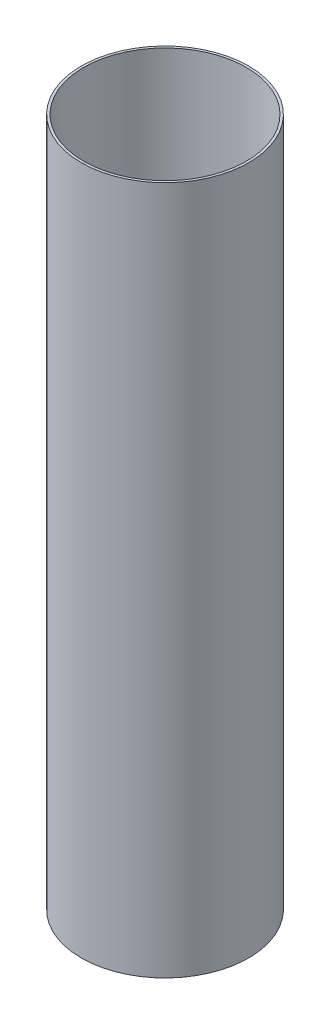
ISO-10303-21;
HEADER;
FILE_DESCRIPTION(('STEP AP214'),'2;1');
FILE_NAME('part.step','',(''),(''),'','','');
FILE_SCHEMA(('AUTOMOTIVE_DESIGN { 1 0 10303 214 1 1 1 1 }'));
ENDSEC;
DATA;
#1=APPLICATION_CONTEXT('core data for automotive mechanical design processes');
#2=APPLICATION_PROTOCOL_DEFINITION('international standard','automotive_design',2000,#1);
#3=PRODUCT_CONTEXT('',#1,'mechanical');
#4=PRODUCT('Part','Part','',(#3));
#5=PRODUCT_RELATED_PRODUCT_CATEGORY('part','',(#4));
#6=PRODUCT_DEFINITION_FORMATION('','',#4);
#7=PRODUCT_DEFINITION_CONTEXT('part definition',#1,'design');
#8=PRODUCT_DEFINITION('design','',#6,#7);
#9=PRODUCT_DEFINITION_SHAPE('','',#8);
#10=(LENGTH_UNIT() NAMED_UNIT(*) SI_UNIT(.MILLI.,.METRE.));
#11=(NAMED_UNIT(*) PLANE_ANGLE_UNIT() SI_UNIT($,.RADIAN.));
#12=(NAMED_UNIT(*) SI_UNIT($,.STERADIAN.) SOLID_ANGLE_UNIT());
#13=UNCERTAINTY_MEASURE_WITH_UNIT(LENGTH_MEASURE(1.E-05),#10,'distance_accuracy_value','');
#14=(GEOMETRIC_REPRESENTATION_CONTEXT(3) GLOBAL_UNCERTAINTY_ASSIGNED_CONTEXT((#13)) GLOBAL_UNIT_ASSIGNED_CONTEXT((#10,
#11,#12)) REPRESENTATION_CONTEXT('',''));
#15=CARTESIAN_POINT('',(0.,0.,0.));
#16=DIRECTION('',(0.,0.,1.));
#17=DIRECTION('',(1.,0.,0.));
#18=AXIS2_PLACEMENT_3D('',#15,#16,#17);
#19=CARTESIAN_POINT('',(0.,419.351000006,0.));
#20=DIRECTION('',(0.,1.,0.));
#21=DIRECTION('',(0.,0.,1.));
#22=AXIS2_PLACEMENT_3D('',#19,#20,#21);
#23=PLANE('',#22);
#24=CARTESIAN_POINT('',(0.,419.351000006,0.));
#25=DIRECTION('',(0.,1.,0.));
#26=DIRECTION('',(0.,0.,1.));
#27=AXIS2_PLACEMENT_3D('',#24,#25,#26);
#28=CIRCLE('',#27,50.9778);
#29=CARTESIAN_POINT('',(0.,419.351000006,50.9778));
#30=VERTEX_POINT('',#29);
#31=EDGE_CURVE('E10',#30,#30,#28,.T.);
#32=ORIENTED_EDGE('',*,*,#31,.T.);
#33=EDGE_LOOP('',(#32));
#34=FACE_BOUND('',#33,.T.);
#35=CARTESIAN_POINT('',(0.,419.351000006,0.));
#36=DIRECTION('',(0.,1.,0.));
#37=DIRECTION('',(0.,0.,1.));
#38=AXIS2_PLACEMENT_3D('',#35,#36,#37);
#39=CIRCLE('',#38,49.53);
#40=CARTESIAN_POINT('',(0.,419.351000006,49.53));
#41=VERTEX_POINT('',#40);
#42=EDGE_CURVE('E47',#41,#41,#39,.T.);
#43=ORIENTED_EDGE('',*,*,#42,.F.);
#44=EDGE_LOOP('',(#43));
#45=FACE_BOUND('',#44,.T.);
#46=ADVANCED_FACE('F36',(#34,#45),#23,.T.);
#47=CARTESIAN_POINT('',(0.,0.,0.));
#48=DIRECTION('',(0.,1.,0.));
#49=DIRECTION('',(0.,0.,1.));
#50=AXIS2_PLACEMENT_3D('',#47,#48,#49);
#51=PLANE('',#50);
#52=CARTESIAN_POINT('',(0.,0.,0.));
#53=DIRECTION('',(0.,1.,0.));
#54=DIRECTION('',(0.,0.,1.));
#55=AXIS2_PLACEMENT_3D('',#52,#53,#54);
#56=CIRCLE('',#55,50.9778);
#57=CARTESIAN_POINT('',(0.,0.,50.9778));
#58=VERTEX_POINT('',#57);
#59=EDGE_CURVE('E40',#58,#58,#56,.T.);
#60=ORIENTED_EDGE('',*,*,#59,.F.);
#61=EDGE_LOOP('',(#60));
#62=FACE_BOUND('',#61,.T.);
#63=CARTESIAN_POINT('',(0.,0.,0.));
#64=DIRECTION('',(0.,1.,0.));
#65=DIRECTION('',(0.,0.,1.));
#66=AXIS2_PLACEMENT_3D('',#63,#64,#65);
#67=CIRCLE('',#66,49.53);
#68=CARTESIAN_POINT('',(0.,0.,49.53));
#69=VERTEX_POINT('',#68);
#70=EDGE_CURVE('E49',#69,#69,#67,.T.);
#71=ORIENTED_EDGE('',*,*,#70,.T.);
#72=EDGE_LOOP('',(#71));
#73=FACE_BOUND('',#72,.T.);
#74=ADVANCED_FACE('F59',(#62,#73),#51,.F.);
#75=CARTESIAN_POINT('',(0.,419.351000006,0.));
#76=DIRECTION('',(0.,-1.,0.));
#77=DIRECTION('',(0.,0.,-1.));
#78=AXIS2_PLACEMENT_3D('',#75,#76,#77);
#79=CYLINDRICAL_SURFACE('',#78,50.9778);
#80=ORIENTED_EDGE('',*,*,#31,.F.);
#81=EDGE_LOOP('',(#80));
#82=FACE_BOUND('',#81,.T.);
#83=ORIENTED_EDGE('',*,*,#59,.T.);
#84=EDGE_LOOP('',(#83));
#85=FACE_BOUND('',#84,.T.);
#86=ADVANCED_FACE('F38',(#82,#85),#79,.T.);
#87=CARTESIAN_POINT('',(0.,419.351000006,0.));
#88=DIRECTION('',(0.,-1.,0.));
#89=DIRECTION('',(0.,0.,-1.));
#90=AXIS2_PLACEMENT_3D('',#87,#88,#89);
#91=CYLINDRICAL_SURFACE('',#90,49.53);
#92=ORIENTED_EDGE('',*,*,#42,.T.);
#93=EDGE_LOOP('',(#92));
#94=FACE_BOUND('',#93,.T.);
#95=ORIENTED_EDGE('',*,*,#70,.F.);
#96=EDGE_LOOP('',(#95));
#97=FACE_BOUND('',#96,.T.);
#98=ADVANCED_FACE('F55',(#94,#97),#91,.F.);
#99=CLOSED_SHELL('',(#46,#74,#86,#98));
#100=MANIFOLD_SOLID_BREP('B2',#99);
#101=ADVANCED_BREP_SHAPE_REPRESENTATION('',(#18,#100),#14);
#102=SHAPE_DEFINITION_REPRESENTATION(#9,#101);
ENDSEC;
END-ISO-10303-21;
